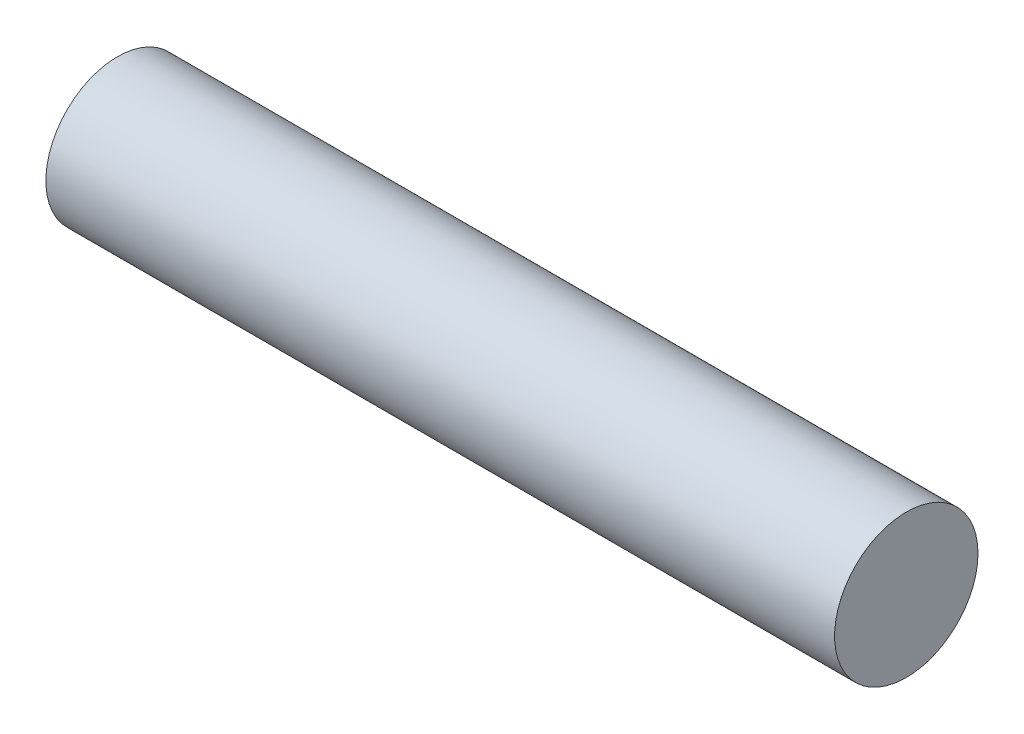
ISO-10303-21;
HEADER;
FILE_DESCRIPTION(('STEP AP214'),'2;1');
FILE_NAME('part.step','',(''),(''),'','','');
FILE_SCHEMA(('AUTOMOTIVE_DESIGN { 1 0 10303 214 1 1 1 1 }'));
ENDSEC;
DATA;
#1=APPLICATION_CONTEXT('core data for automotive mechanical design processes');
#2=APPLICATION_PROTOCOL_DEFINITION('international standard','automotive_design',2000,#1);
#3=PRODUCT_CONTEXT('',#1,'mechanical');
#4=PRODUCT('Part','Part','',(#3));
#5=PRODUCT_RELATED_PRODUCT_CATEGORY('part','',(#4));
#6=PRODUCT_DEFINITION_FORMATION('','',#4);
#7=PRODUCT_DEFINITION_CONTEXT('part definition',#1,'design');
#8=PRODUCT_DEFINITION('design','',#6,#7);
#9=PRODUCT_DEFINITION_SHAPE('','',#8);
#10=(LENGTH_UNIT() NAMED_UNIT(*) SI_UNIT(.MILLI.,.METRE.));
#11=(NAMED_UNIT(*) PLANE_ANGLE_UNIT() SI_UNIT($,.RADIAN.));
#12=(NAMED_UNIT(*) SI_UNIT($,.STERADIAN.) SOLID_ANGLE_UNIT());
#13=UNCERTAINTY_MEASURE_WITH_UNIT(LENGTH_MEASURE(1.E-05),#10,'distance_accuracy_value','');
#14=(GEOMETRIC_REPRESENTATION_CONTEXT(3) GLOBAL_UNCERTAINTY_ASSIGNED_CONTEXT((#13)) GLOBAL_UNIT_ASSIGNED_CONTEXT((#10,
#11,#12)) REPRESENTATION_CONTEXT('',''));
#15=CARTESIAN_POINT('',(0.,0.,0.));
#16=DIRECTION('',(0.,0.,1.));
#17=DIRECTION('',(1.,0.,0.));
#18=AXIS2_PLACEMENT_3D('',#15,#16,#17);
#19=CARTESIAN_POINT('',(22.,0.,0.));
#20=DIRECTION('',(-1.,0.,0.));
#21=DIRECTION('',(0.,0.,1.));
#22=AXIS2_PLACEMENT_3D('',#19,#20,#21);
#23=CYLINDRICAL_SURFACE('',#22,2.);
#24=CARTESIAN_POINT('',(22.,0.,0.));
#25=DIRECTION('',(1.,0.,0.));
#26=DIRECTION('',(0.,0.,-1.));
#27=AXIS2_PLACEMENT_3D('',#24,#25,#26);
#28=CIRCLE('',#27,2.);
#29=CARTESIAN_POINT('',(22.,0.,-2.));
#30=VERTEX_POINT('',#29);
#31=EDGE_CURVE('E10',#30,#30,#28,.T.);
#32=ORIENTED_EDGE('',*,*,#31,.F.);
#33=EDGE_LOOP('',(#32));
#34=FACE_BOUND('',#33,.T.);
#35=CARTESIAN_POINT('',(0.,0.,0.));
#36=DIRECTION('',(1.,0.,0.));
#37=DIRECTION('',(0.,0.,-1.));
#38=AXIS2_PLACEMENT_3D('',#35,#36,#37);
#39=CIRCLE('',#38,2.);
#40=CARTESIAN_POINT('',(0.,0.,-2.));
#41=VERTEX_POINT('',#40);
#42=EDGE_CURVE('E34',#41,#41,#39,.T.);
#43=ORIENTED_EDGE('',*,*,#42,.T.);
#44=EDGE_LOOP('',(#43));
#45=FACE_BOUND('',#44,.T.);
#46=ADVANCED_FACE('F31',(#34,#45),#23,.T.);
#47=CARTESIAN_POINT('',(22.,0.,0.));
#48=DIRECTION('',(1.,0.,0.));
#49=DIRECTION('',(0.,0.,-1.));
#50=AXIS2_PLACEMENT_3D('',#47,#48,#49);
#51=PLANE('',#50);
#52=ORIENTED_EDGE('',*,*,#31,.T.);
#53=EDGE_LOOP('',(#52));
#54=FACE_BOUND('',#53,.T.);
#55=ADVANCED_FACE('F46',(#54),#51,.T.);
#56=CARTESIAN_POINT('',(0.,0.,0.));
#57=DIRECTION('',(1.,0.,0.));
#58=DIRECTION('',(0.,0.,-1.));
#59=AXIS2_PLACEMENT_3D('',#56,#57,#58);
#60=PLANE('',#59);
#61=ORIENTED_EDGE('',*,*,#42,.F.);
#62=EDGE_LOOP('',(#61));
#63=FACE_BOUND('',#62,.T.);
#64=ADVANCED_FACE('F44',(#63),#60,.F.);
#65=CLOSED_SHELL('',(#46,#55,#64));
#66=MANIFOLD_SOLID_BREP('B2',#65);
#67=ADVANCED_BREP_SHAPE_REPRESENTATION('',(#18,#66),#14);
#68=SHAPE_DEFINITION_REPRESENTATION(#9,#67);
ENDSEC;
END-ISO-10303-21;
